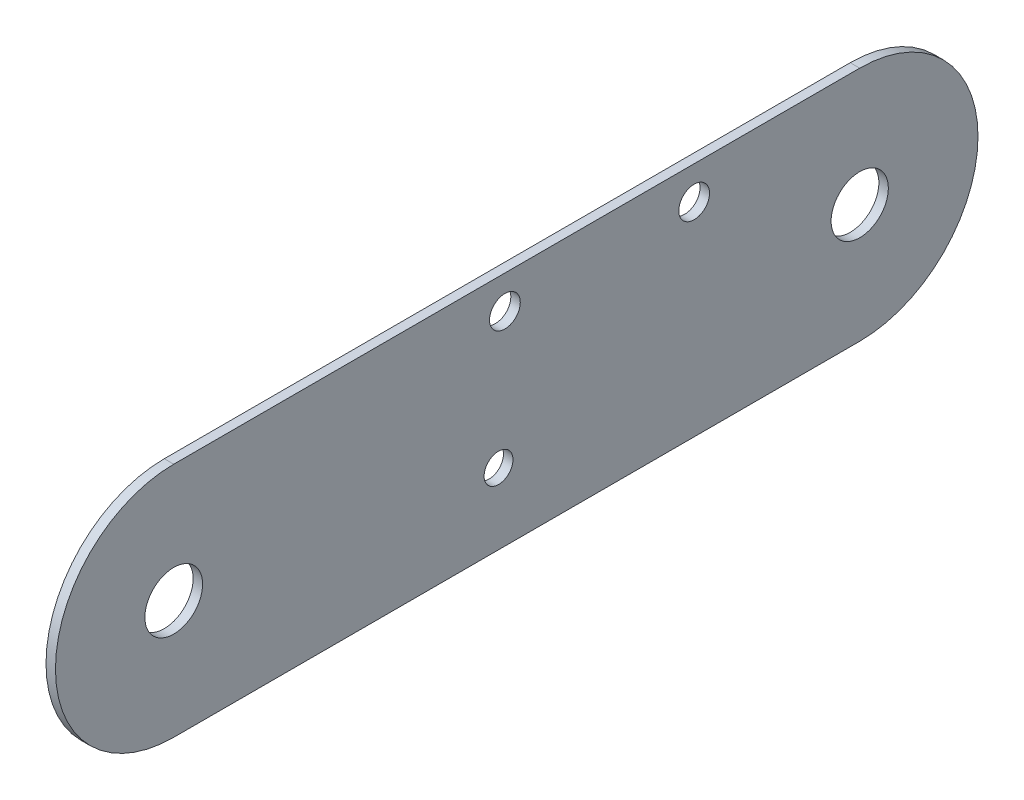
ISO-10303-21;
HEADER;
FILE_DESCRIPTION(('STEP AP214'),'2;1');
FILE_NAME('part.step','',(''),(''),'','','');
FILE_SCHEMA(('AUTOMOTIVE_DESIGN { 1 0 10303 214 1 1 1 1 }'));
ENDSEC;
DATA;
#1=APPLICATION_CONTEXT('core data for automotive mechanical design processes');
#2=APPLICATION_PROTOCOL_DEFINITION('international standard','automotive_design',2000,#1);
#3=PRODUCT_CONTEXT('',#1,'mechanical');
#4=PRODUCT('Part','Part','',(#3));
#5=PRODUCT_RELATED_PRODUCT_CATEGORY('part','',(#4));
#6=PRODUCT_DEFINITION_FORMATION('','',#4);
#7=PRODUCT_DEFINITION_CONTEXT('part definition',#1,'design');
#8=PRODUCT_DEFINITION('design','',#6,#7);
#9=PRODUCT_DEFINITION_SHAPE('','',#8);
#10=(LENGTH_UNIT() NAMED_UNIT(*) SI_UNIT(.MILLI.,.METRE.));
#11=(NAMED_UNIT(*) PLANE_ANGLE_UNIT() SI_UNIT($,.RADIAN.));
#12=(NAMED_UNIT(*) SI_UNIT($,.STERADIAN.) SOLID_ANGLE_UNIT());
#13=UNCERTAINTY_MEASURE_WITH_UNIT(LENGTH_MEASURE(1.E-05),#10,'distance_accuracy_value','');
#14=(GEOMETRIC_REPRESENTATION_CONTEXT(3) GLOBAL_UNCERTAINTY_ASSIGNED_CONTEXT((#13)) GLOBAL_UNIT_ASSIGNED_CONTEXT((#10,
#11,#12)) REPRESENTATION_CONTEXT('',''));
#15=CARTESIAN_POINT('',(0.,0.,0.));
#16=DIRECTION('',(0.,0.,1.));
#17=DIRECTION('',(1.,0.,0.));
#18=AXIS2_PLACEMENT_3D('',#15,#16,#17);
#19=CARTESIAN_POINT('',(2.,-33.6473670974886,125.573683548745));
#20=DIRECTION('',(1.,0.,0.));
#21=DIRECTION('',(0.,0.,-1.));
#22=AXIS2_PLACEMENT_3D('',#19,#20,#21);
#23=PLANE('',#22);
#24=CARTESIAN_POINT('',(2.,-15.6473670974885,15.5736835487447));
#25=DIRECTION('',(1.,0.,0.));
#26=DIRECTION('',(0.,0.,-1.));
#27=AXIS2_PLACEMENT_3D('',#24,#25,#26);
#28=CIRCLE('',#27,3.24999999999998);
#29=CARTESIAN_POINT('',(2.,-15.6473670974885,12.3236835487448));
#30=VERTEX_POINT('',#29);
#31=EDGE_CURVE('E129',#30,#30,#28,.T.);
#32=ORIENTED_EDGE('',*,*,#31,.F.);
#33=EDGE_LOOP('',(#32));
#34=FACE_BOUND('',#33,.T.);
#35=CARTESIAN_POINT('',(2.,-33.6473670974886,125.573683548745));
#36=DIRECTION('',(1.,0.,0.));
#37=DIRECTION('',(0.,0.,-1.));
#38=AXIS2_PLACEMENT_3D('',#35,#36,#37);
#39=CIRCLE('',#38,6.10000000000001);
#40=CARTESIAN_POINT('',(2.,-33.6473670974886,119.473683548745));
#41=VERTEX_POINT('',#40);
#42=EDGE_CURVE('E117',#41,#41,#39,.T.);
#43=ORIENTED_EDGE('',*,*,#42,.F.);
#44=EDGE_LOOP('',(#43));
#45=FACE_BOUND('',#44,.T.);
#46=CARTESIAN_POINT('',(2.,-33.6473670974886,125.573683548745));
#47=DIRECTION('',(1.,0.,0.));
#48=DIRECTION('',(0.,0.,-1.));
#49=AXIS2_PLACEMENT_3D('',#46,#47,#48);
#50=CIRCLE('',#49,25.);
#51=CARTESIAN_POINT('',(2.,-8.64736709748853,125.573683548745));
#52=VERTEX_POINT('',#51);
#53=CARTESIAN_POINT('',(2.,-58.6473670974885,125.573683548745));
#54=VERTEX_POINT('',#53);
#55=EDGE_CURVE('E88',#52,#54,#50,.T.);
#56=ORIENTED_EDGE('',*,*,#55,.T.);
#57=DIRECTION('',(0.,0.,-1.));
#58=VECTOR('',#57,1.);
#59=CARTESIAN_POINT('',(2.,-58.6473670974885,-19.4263164512572));
#60=LINE('',#59,#58);
#61=CARTESIAN_POINT('',(2.,-58.6473670974885,-19.4263164512572));
#62=VERTEX_POINT('',#61);
#63=EDGE_CURVE('E82',#54,#62,#60,.T.);
#64=ORIENTED_EDGE('',*,*,#63,.T.);
#65=CARTESIAN_POINT('',(2.,-33.6473670974885,-19.4263164512572));
#66=DIRECTION('',(1.,0.,0.));
#67=DIRECTION('',(0.,0.,-1.));
#68=AXIS2_PLACEMENT_3D('',#65,#66,#67);
#69=CIRCLE('',#68,25.);
#70=CARTESIAN_POINT('',(2.,-8.6473670974885,-19.4263164512572));
#71=VERTEX_POINT('',#70);
#72=EDGE_CURVE('E85',#62,#71,#69,.T.);
#73=ORIENTED_EDGE('',*,*,#72,.T.);
#74=DIRECTION('',(0.,0.,1.));
#75=VECTOR('',#74,1.);
#76=CARTESIAN_POINT('',(2.,-8.64736709748852,-4.99255972151651));
#77=LINE('',#76,#75);
#78=EDGE_CURVE('E54',#71,#52,#77,.T.);
#79=ORIENTED_EDGE('',*,*,#78,.T.);
#80=EDGE_LOOP('',(#56,#64,#73,#79));
#81=FACE_BOUND('',#80,.T.);
#82=CARTESIAN_POINT('',(2.,-33.6473670974885,-19.4263164512572));
#83=DIRECTION('',(1.,0.,0.));
#84=DIRECTION('',(0.,0.,-1.));
#85=AXIS2_PLACEMENT_3D('',#82,#83,#84);
#86=CIRCLE('',#85,6.05000000000001);
#87=CARTESIAN_POINT('',(2.,-33.6473670974885,-25.4763164512572));
#88=VERTEX_POINT('',#87);
#89=EDGE_CURVE('E105',#88,#88,#86,.T.);
#90=ORIENTED_EDGE('',*,*,#89,.F.);
#91=EDGE_LOOP('',(#90));
#92=FACE_BOUND('',#91,.T.);
#93=CARTESIAN_POINT('',(2.,-43.6473670974885,56.9215715352484));
#94=DIRECTION('',(1.,0.,0.));
#95=DIRECTION('',(0.,0.,-1.));
#96=AXIS2_PLACEMENT_3D('',#93,#94,#95);
#97=CIRCLE('',#96,3.05);
#98=CARTESIAN_POINT('',(2.,-43.6473670974885,53.8715715352484));
#99=VERTEX_POINT('',#98);
#100=EDGE_CURVE('E123',#99,#99,#97,.T.);
#101=ORIENTED_EDGE('',*,*,#100,.F.);
#102=EDGE_LOOP('',(#101));
#103=FACE_BOUND('',#102,.T.);
#104=CARTESIAN_POINT('',(2.,-15.6473670974885,55.5736835487447));
#105=DIRECTION('',(1.,0.,0.));
#106=DIRECTION('',(0.,0.,-1.));
#107=AXIS2_PLACEMENT_3D('',#104,#105,#106);
#108=CIRCLE('',#107,3.25);
#109=CARTESIAN_POINT('',(2.,-15.6473670974885,52.3236835487447));
#110=VERTEX_POINT('',#109);
#111=EDGE_CURVE('E135',#110,#110,#108,.T.);
#112=ORIENTED_EDGE('',*,*,#111,.F.);
#113=EDGE_LOOP('',(#112));
#114=FACE_BOUND('',#113,.T.);
#115=ADVANCED_FACE('F37',(#34,#45,#81,#92,#103,#114),#23,.T.);
#116=CARTESIAN_POINT('',(0.,-33.6473670974886,125.573683548745));
#117=DIRECTION('',(1.,0.,0.));
#118=DIRECTION('',(0.,0.,-1.));
#119=AXIS2_PLACEMENT_3D('',#116,#117,#118);
#120=PLANE('',#119);
#121=CARTESIAN_POINT('',(0.,-33.6473670974886,125.573683548745));
#122=DIRECTION('',(1.,0.,0.));
#123=DIRECTION('',(0.,0.,-1.));
#124=AXIS2_PLACEMENT_3D('',#121,#122,#123);
#125=CIRCLE('',#124,25.);
#126=CARTESIAN_POINT('',(0.,-8.64736709748853,125.573683548745));
#127=VERTEX_POINT('',#126);
#128=CARTESIAN_POINT('',(0.,-58.6473670974885,125.573683548745));
#129=VERTEX_POINT('',#128);
#130=EDGE_CURVE('E102',#127,#129,#125,.T.);
#131=ORIENTED_EDGE('',*,*,#130,.F.);
#132=DIRECTION('',(0.,0.,1.));
#133=VECTOR('',#132,1.);
#134=CARTESIAN_POINT('',(0.,-8.64736709748852,-4.99255972151651));
#135=LINE('',#134,#133);
#136=CARTESIAN_POINT('',(0.,-8.6473670974885,-19.4263164512572));
#137=VERTEX_POINT('',#136);
#138=EDGE_CURVE('E71',#137,#127,#135,.T.);
#139=ORIENTED_EDGE('',*,*,#138,.F.);
#140=CARTESIAN_POINT('',(0.,-33.6473670974885,-19.4263164512572));
#141=DIRECTION('',(1.,0.,0.));
#142=DIRECTION('',(0.,0.,-1.));
#143=AXIS2_PLACEMENT_3D('',#140,#141,#142);
#144=CIRCLE('',#143,25.);
#145=CARTESIAN_POINT('',(0.,-58.6473670974885,-19.4263164512572));
#146=VERTEX_POINT('',#145);
#147=EDGE_CURVE('E107',#146,#137,#144,.T.);
#148=ORIENTED_EDGE('',*,*,#147,.F.);
#149=DIRECTION('',(0.,0.,-1.));
#150=VECTOR('',#149,1.);
#151=CARTESIAN_POINT('',(0.,-58.6473670974885,-19.4263164512572));
#152=LINE('',#151,#150);
#153=EDGE_CURVE('E93',#129,#146,#152,.T.);
#154=ORIENTED_EDGE('',*,*,#153,.F.);
#155=EDGE_LOOP('',(#131,#139,#148,#154));
#156=FACE_BOUND('',#155,.T.);
#157=CARTESIAN_POINT('',(0.,-33.6473670974885,-19.4263164512572));
#158=DIRECTION('',(1.,0.,0.));
#159=DIRECTION('',(0.,0.,-1.));
#160=AXIS2_PLACEMENT_3D('',#157,#158,#159);
#161=CIRCLE('',#160,6.05000000000001);
#162=CARTESIAN_POINT('',(0.,-33.6473670974885,-25.4763164512572));
#163=VERTEX_POINT('',#162);
#164=EDGE_CURVE('E114',#163,#163,#161,.T.);
#165=ORIENTED_EDGE('',*,*,#164,.T.);
#166=EDGE_LOOP('',(#165));
#167=FACE_BOUND('',#166,.T.);
#168=CARTESIAN_POINT('',(0.,-33.6473670974886,125.573683548745));
#169=DIRECTION('',(1.,0.,0.));
#170=DIRECTION('',(0.,0.,-1.));
#171=AXIS2_PLACEMENT_3D('',#168,#169,#170);
#172=CIRCLE('',#171,6.10000000000001);
#173=CARTESIAN_POINT('',(0.,-33.6473670974886,119.473683548745));
#174=VERTEX_POINT('',#173);
#175=EDGE_CURVE('E120',#174,#174,#172,.T.);
#176=ORIENTED_EDGE('',*,*,#175,.T.);
#177=EDGE_LOOP('',(#176));
#178=FACE_BOUND('',#177,.T.);
#179=CARTESIAN_POINT('',(0.,-43.6473670974885,56.9215715352484));
#180=DIRECTION('',(1.,0.,0.));
#181=DIRECTION('',(0.,0.,-1.));
#182=AXIS2_PLACEMENT_3D('',#179,#180,#181);
#183=CIRCLE('',#182,3.05);
#184=CARTESIAN_POINT('',(0.,-43.6473670974885,53.8715715352484));
#185=VERTEX_POINT('',#184);
#186=EDGE_CURVE('E126',#185,#185,#183,.T.);
#187=ORIENTED_EDGE('',*,*,#186,.T.);
#188=EDGE_LOOP('',(#187));
#189=FACE_BOUND('',#188,.T.);
#190=CARTESIAN_POINT('',(0.,-15.6473670974885,15.5736835487447));
#191=DIRECTION('',(1.,0.,0.));
#192=DIRECTION('',(0.,0.,-1.));
#193=AXIS2_PLACEMENT_3D('',#190,#191,#192);
#194=CIRCLE('',#193,3.24999999999998);
#195=CARTESIAN_POINT('',(0.,-15.6473670974885,12.3236835487448));
#196=VERTEX_POINT('',#195);
#197=EDGE_CURVE('E132',#196,#196,#194,.T.);
#198=ORIENTED_EDGE('',*,*,#197,.T.);
#199=EDGE_LOOP('',(#198));
#200=FACE_BOUND('',#199,.T.);
#201=CARTESIAN_POINT('',(0.,-15.6473670974885,55.5736835487447));
#202=DIRECTION('',(1.,0.,0.));
#203=DIRECTION('',(0.,0.,-1.));
#204=AXIS2_PLACEMENT_3D('',#201,#202,#203);
#205=CIRCLE('',#204,3.25);
#206=CARTESIAN_POINT('',(0.,-15.6473670974885,52.3236835487447));
#207=VERTEX_POINT('',#206);
#208=EDGE_CURVE('E138',#207,#207,#205,.T.);
#209=ORIENTED_EDGE('',*,*,#208,.T.);
#210=EDGE_LOOP('',(#209));
#211=FACE_BOUND('',#210,.T.);
#212=ADVANCED_FACE('F148',(#156,#167,#178,#189,#200,#211),#120,.F.);
#213=CARTESIAN_POINT('',(2.,-33.6473670974886,125.573683548745));
#214=DIRECTION('',(-1.,0.,0.));
#215=DIRECTION('',(0.,0.,1.));
#216=AXIS2_PLACEMENT_3D('',#213,#214,#215);
#217=CYLINDRICAL_SURFACE('',#216,25.);
#218=ORIENTED_EDGE('',*,*,#130,.T.);
#219=DIRECTION('',(-1.,0.,0.));
#220=VECTOR('',#219,1.);
#221=CARTESIAN_POINT('',(2.,-58.6473670974885,125.573683548745));
#222=LINE('',#221,#220);
#223=EDGE_CURVE('E11',#54,#129,#222,.T.);
#224=ORIENTED_EDGE('',*,*,#223,.F.);
#225=ORIENTED_EDGE('',*,*,#55,.F.);
#226=DIRECTION('',(-1.,0.,0.));
#227=VECTOR('',#226,1.);
#228=CARTESIAN_POINT('',(2.,-8.64736709748853,125.573683548745));
#229=LINE('',#228,#227);
#230=EDGE_CURVE('E98',#52,#127,#229,.T.);
#231=ORIENTED_EDGE('',*,*,#230,.T.);
#232=EDGE_LOOP('',(#218,#224,#225,#231));
#233=FACE_BOUND('',#232,.T.);
#234=ADVANCED_FACE('F39',(#233),#217,.T.);
#235=CARTESIAN_POINT('',(2.,-58.6473670974885,-19.4263164512572));
#236=DIRECTION('',(0.,1.,0.));
#237=DIRECTION('',(0.,0.,1.));
#238=AXIS2_PLACEMENT_3D('',#235,#236,#237);
#239=PLANE('',#238);
#240=ORIENTED_EDGE('',*,*,#153,.T.);
#241=DIRECTION('',(-1.,0.,0.));
#242=VECTOR('',#241,1.);
#243=CARTESIAN_POINT('',(2.,-58.6473670974885,-19.4263164512572));
#244=LINE('',#243,#242);
#245=EDGE_CURVE('E46',#62,#146,#244,.T.);
#246=ORIENTED_EDGE('',*,*,#245,.F.);
#247=ORIENTED_EDGE('',*,*,#63,.F.);
#248=ORIENTED_EDGE('',*,*,#223,.T.);
#249=EDGE_LOOP('',(#240,#246,#247,#248));
#250=FACE_BOUND('',#249,.T.);
#251=ADVANCED_FACE('F92',(#250),#239,.F.);
#252=CARTESIAN_POINT('',(2.,-33.6473670974885,-19.4263164512572));
#253=DIRECTION('',(-1.,0.,0.));
#254=DIRECTION('',(0.,0.,1.));
#255=AXIS2_PLACEMENT_3D('',#252,#253,#254);
#256=CYLINDRICAL_SURFACE('',#255,25.);
#257=ORIENTED_EDGE('',*,*,#147,.T.);
#258=DIRECTION('',(-1.,0.,0.));
#259=VECTOR('',#258,1.);
#260=CARTESIAN_POINT('',(2.,-8.6473670974885,-19.4263164512572));
#261=LINE('',#260,#259);
#262=EDGE_CURVE('E95',#71,#137,#261,.T.);
#263=ORIENTED_EDGE('',*,*,#262,.F.);
#264=ORIENTED_EDGE('',*,*,#72,.F.);
#265=ORIENTED_EDGE('',*,*,#245,.T.);
#266=EDGE_LOOP('',(#257,#263,#264,#265));
#267=FACE_BOUND('',#266,.T.);
#268=ADVANCED_FACE('F96',(#267),#256,.T.);
#269=CARTESIAN_POINT('',(2.,-8.64736709748852,-4.99255972151651));
#270=DIRECTION('',(0.,-1.,0.));
#271=DIRECTION('',(0.,0.,-1.));
#272=AXIS2_PLACEMENT_3D('',#269,#270,#271);
#273=PLANE('',#272);
#274=ORIENTED_EDGE('',*,*,#138,.T.);
#275=ORIENTED_EDGE('',*,*,#230,.F.);
#276=ORIENTED_EDGE('',*,*,#78,.F.);
#277=ORIENTED_EDGE('',*,*,#262,.T.);
#278=EDGE_LOOP('',(#274,#275,#276,#277));
#279=FACE_BOUND('',#278,.T.);
#280=ADVANCED_FACE('F111',(#279),#273,.F.);
#281=CARTESIAN_POINT('',(2.,-33.6473670974885,-19.4263164512572));
#282=DIRECTION('',(-1.,0.,0.));
#283=DIRECTION('',(0.,0.,1.));
#284=AXIS2_PLACEMENT_3D('',#281,#282,#283);
#285=CYLINDRICAL_SURFACE('',#284,6.05000000000001);
#286=ORIENTED_EDGE('',*,*,#89,.T.);
#287=EDGE_LOOP('',(#286));
#288=FACE_BOUND('',#287,.T.);
#289=ORIENTED_EDGE('',*,*,#164,.F.);
#290=EDGE_LOOP('',(#289));
#291=FACE_BOUND('',#290,.T.);
#292=ADVANCED_FACE('F158',(#288,#291),#285,.F.);
#293=CARTESIAN_POINT('',(2.,-33.6473670974886,125.573683548745));
#294=DIRECTION('',(-1.,0.,0.));
#295=DIRECTION('',(0.,0.,1.));
#296=AXIS2_PLACEMENT_3D('',#293,#294,#295);
#297=CYLINDRICAL_SURFACE('',#296,6.10000000000001);
#298=ORIENTED_EDGE('',*,*,#42,.T.);
#299=EDGE_LOOP('',(#298));
#300=FACE_BOUND('',#299,.T.);
#301=ORIENTED_EDGE('',*,*,#175,.F.);
#302=EDGE_LOOP('',(#301));
#303=FACE_BOUND('',#302,.T.);
#304=ADVANCED_FACE('F207',(#300,#303),#297,.F.);
#305=CARTESIAN_POINT('',(2.,-43.6473670974885,56.9215715352484));
#306=DIRECTION('',(-1.,0.,0.));
#307=DIRECTION('',(0.,0.,1.));
#308=AXIS2_PLACEMENT_3D('',#305,#306,#307);
#309=CYLINDRICAL_SURFACE('',#308,3.05);
#310=ORIENTED_EDGE('',*,*,#100,.T.);
#311=EDGE_LOOP('',(#310));
#312=FACE_BOUND('',#311,.T.);
#313=ORIENTED_EDGE('',*,*,#186,.F.);
#314=EDGE_LOOP('',(#313));
#315=FACE_BOUND('',#314,.T.);
#316=ADVANCED_FACE('F215',(#312,#315),#309,.F.);
#317=CARTESIAN_POINT('',(2.,-15.6473670974885,15.5736835487447));
#318=DIRECTION('',(-1.,0.,0.));
#319=DIRECTION('',(0.,0.,1.));
#320=AXIS2_PLACEMENT_3D('',#317,#318,#319);
#321=CYLINDRICAL_SURFACE('',#320,3.24999999999998);
#322=ORIENTED_EDGE('',*,*,#31,.T.);
#323=EDGE_LOOP('',(#322));
#324=FACE_BOUND('',#323,.T.);
#325=ORIENTED_EDGE('',*,*,#197,.F.);
#326=EDGE_LOOP('',(#325));
#327=FACE_BOUND('',#326,.T.);
#328=ADVANCED_FACE('F223',(#324,#327),#321,.F.);
#329=CARTESIAN_POINT('',(2.,-15.6473670974885,55.5736835487447));
#330=DIRECTION('',(-1.,0.,0.));
#331=DIRECTION('',(0.,0.,1.));
#332=AXIS2_PLACEMENT_3D('',#329,#330,#331);
#333=CYLINDRICAL_SURFACE('',#332,3.25);
#334=ORIENTED_EDGE('',*,*,#111,.T.);
#335=EDGE_LOOP('',(#334));
#336=FACE_BOUND('',#335,.T.);
#337=ORIENTED_EDGE('',*,*,#208,.F.);
#338=EDGE_LOOP('',(#337));
#339=FACE_BOUND('',#338,.T.);
#340=ADVANCED_FACE('F144',(#336,#339),#333,.F.);
#341=CLOSED_SHELL('',(#115,#212,#234,#251,#268,#280,#292,#304,#316,#328,#340));
#342=MANIFOLD_SOLID_BREP('B2',#341);
#343=ADVANCED_BREP_SHAPE_REPRESENTATION('',(#18,#342),#14);
#344=SHAPE_DEFINITION_REPRESENTATION(#9,#343);
ENDSEC;
END-ISO-10303-21;
